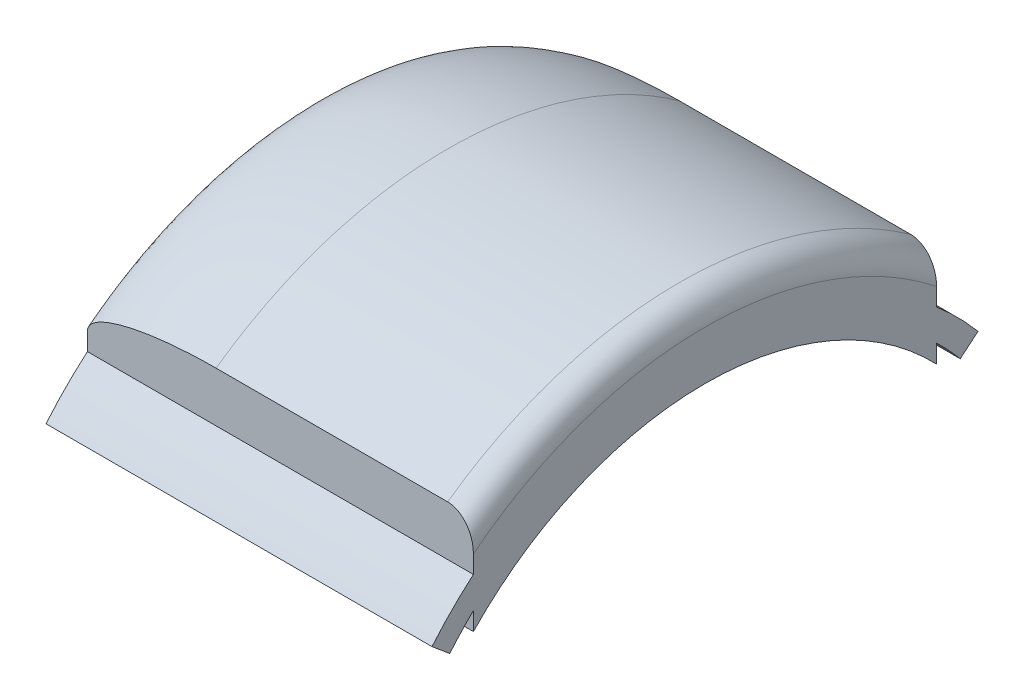
ISO-10303-21;
HEADER;
FILE_DESCRIPTION(('STEP AP214'),'2;1');
FILE_NAME('part.step','',(''),(''),'','','');
FILE_SCHEMA(('AUTOMOTIVE_DESIGN { 1 0 10303 214 1 1 1 1 }'));
ENDSEC;
DATA;
#1=APPLICATION_CONTEXT('core data for automotive mechanical design processes');
#2=APPLICATION_PROTOCOL_DEFINITION('international standard','automotive_design',2000,#1);
#3=PRODUCT_CONTEXT('',#1,'mechanical');
#4=PRODUCT('Part','Part','',(#3));
#5=PRODUCT_RELATED_PRODUCT_CATEGORY('part','',(#4));
#6=PRODUCT_DEFINITION_FORMATION('','',#4);
#7=PRODUCT_DEFINITION_CONTEXT('part definition',#1,'design');
#8=PRODUCT_DEFINITION('design','',#6,#7);
#9=PRODUCT_DEFINITION_SHAPE('','',#8);
#10=(LENGTH_UNIT() NAMED_UNIT(*) SI_UNIT(.MILLI.,.METRE.));
#11=(NAMED_UNIT(*) PLANE_ANGLE_UNIT() SI_UNIT($,.RADIAN.));
#12=(NAMED_UNIT(*) SI_UNIT($,.STERADIAN.) SOLID_ANGLE_UNIT());
#13=UNCERTAINTY_MEASURE_WITH_UNIT(LENGTH_MEASURE(1.E-05),#10,'distance_accuracy_value','');
#14=(GEOMETRIC_REPRESENTATION_CONTEXT(3) GLOBAL_UNCERTAINTY_ASSIGNED_CONTEXT((#13)) GLOBAL_UNIT_ASSIGNED_CONTEXT((#10,
#11,#12)) REPRESENTATION_CONTEXT('',''));
#15=CARTESIAN_POINT('',(0.,0.,0.));
#16=DIRECTION('',(0.,0.,1.));
#17=DIRECTION('',(1.,0.,0.));
#18=AXIS2_PLACEMENT_3D('',#15,#16,#17);
#19=CARTESIAN_POINT('',(9.99368105866197,0.,0.));
#20=DIRECTION('',(1.,0.,0.));
#21=DIRECTION('',(0.,0.,-1.));
#22=AXIS2_PLACEMENT_3D('',#19,#20,#21);
#23=PLANE('',#22);
#24=DIRECTION('',(0.,1.,0.));
#25=VECTOR('',#24,1.);
#26=CARTESIAN_POINT('',(9.99368105866197,0.,9.));
#27=LINE('',#26,#25);
#28=CARTESIAN_POINT('',(9.99368105866197,10.6772266053315,9.));
#29=VERTEX_POINT('',#28);
#30=CARTESIAN_POINT('',(9.99368105866197,11.3687698869462,9.));
#31=VERTEX_POINT('',#30);
#32=EDGE_CURVE('E210',#29,#31,#27,.T.);
#33=ORIENTED_EDGE('',*,*,#32,.T.);
#34=CARTESIAN_POINT('',(9.99368105866197,10.7411284823532,-9.74054202421923));
#35=CARTESIAN_POINT('',(9.99368105866197,11.3390278399777,-9.08122411318734));
#36=CARTESIAN_POINT('',(9.99368105866197,11.876029441084,-8.36672543807604));
#37=CARTESIAN_POINT('',(9.99368105866197,12.8101509913579,-6.85143790895524));
#38=CARTESIAN_POINT('',(9.99368105866197,13.2072478210634,-6.05068383198596));
#39=CARTESIAN_POINT('',(9.99368105866197,13.8481162679346,-4.38997103309587));
#40=CARTESIAN_POINT('',(9.99368105866197,14.0918756244839,-3.53004408268645));
#41=CARTESIAN_POINT('',(9.99368105866197,14.4178206083852,-1.78006144446919));
#42=CARTESIAN_POINT('',(9.99368105866197,14.5,-0.89003923601606));
#43=CARTESIAN_POINT('',(9.99368105866197,14.5,0.890039236016077));
#44=CARTESIAN_POINT('',(9.99368105866197,14.4178206083845,1.7800614444692));
#45=CARTESIAN_POINT('',(9.99368105866197,14.0918756244846,3.53004408268646));
#46=CARTESIAN_POINT('',(9.99368105866197,13.8481162679346,4.3899710330955));
#47=CARTESIAN_POINT('',(9.99368105866197,13.2072478210634,6.05068383198636));
#48=CARTESIAN_POINT('',(9.99368105866197,12.8101509913571,6.85143790895525));
#49=CARTESIAN_POINT('',(9.99368105866197,11.8760294410847,8.36672543807604));
#50=CARTESIAN_POINT('',(9.99368105866197,11.3390278399762,9.08122411318656));
#51=CARTESIAN_POINT('',(9.99368105866197,10.7411284823532,9.74054202421923));
#52=(BOUNDED_CURVE() B_SPLINE_CURVE(3,(#34,#35,#36,#37,#38,#39,#40,#41,#42,#43,#44,#45,#46,#47,
#48,#49,#50,#51),.UNSPECIFIED.,.F.,.F.) B_SPLINE_CURVE_WITH_KNOTS((4,2,2,2,2,2,2,2,4),
(0.834212130887358,1.01835817986424,1.20250422884113,1.38665027781801,1.5707963267949,
1.75494237577178,1.93908842474867,2.12323447372555,2.30738052270244),
.UNSPECIFIED.) CURVE() GEOMETRIC_REPRESENTATION_ITEM() RATIONAL_B_SPLINE_CURVE((1.,1.,1.,1.,1.,
1.,1.,1.,1.,1.,1.,1.,1.,1.,1.,1.,1.,1.)) REPRESENTATION_ITEM(''));
#53=CARTESIAN_POINT('',(9.99368105866197,11.3687698869544,-9.));
#54=VERTEX_POINT('',#53);
#55=EDGE_CURVE('E54',#31,#54,#52,.F.);
#56=ORIENTED_EDGE('',*,*,#55,.T.);
#57=DIRECTION('',(0.,1.,0.));
#58=VECTOR('',#57,1.);
#59=CARTESIAN_POINT('',(9.99368105866197,0.,-9.));
#60=LINE('',#59,#58);
#61=CARTESIAN_POINT('',(9.99368105866197,10.6772266053315,-9.));
#62=VERTEX_POINT('',#61);
#63=EDGE_CURVE('E330',#62,#54,#60,.T.);
#64=ORIENTED_EDGE('',*,*,#63,.F.);
#65=CARTESIAN_POINT('',(9.99368105866197,0.149999999999999,0.));
#66=DIRECTION('',(1.,0.,0.));
#67=DIRECTION('',(0.,0.,-1.));
#68=AXIS2_PLACEMENT_3D('',#65,#66,#67);
#69=CIRCLE('',#68,13.85);
#70=CARTESIAN_POINT('',(9.99368105866197,9.05260839415855,-10.6097155371979));
#71=VERTEX_POINT('',#70);
#72=EDGE_CURVE('E173',#71,#62,#69,.T.);
#73=ORIENTED_EDGE('',*,*,#72,.F.);
#74=DIRECTION('',(0.,-0.642787609686535,0.766044443118981));
#75=VECTOR('',#74,1.);
#76=CARTESIAN_POINT('',(9.99368105866197,0.0880236133250594,0.0738605814759481));
#77=LINE('',#76,#75);
#78=CARTESIAN_POINT('',(9.99368105866197,8.47409954544067,-9.92027553839077));
#79=VERTEX_POINT('',#78);
#80=EDGE_CURVE('E350',#71,#79,#77,.T.);
#81=ORIENTED_EDGE('',*,*,#80,.T.);
#82=CARTESIAN_POINT('',(9.99368105866197,0.149999999999999,0.));
#83=DIRECTION('',(1.,0.,0.));
#84=DIRECTION('',(0.,0.,-1.));
#85=AXIS2_PLACEMENT_3D('',#82,#83,#84);
#86=CIRCLE('',#85,12.95);
#87=CARTESIAN_POINT('',(9.99368105866197,9.46141772234496,-9.));
#88=VERTEX_POINT('',#87);
#89=EDGE_CURVE('E340',#79,#88,#86,.T.);
#90=ORIENTED_EDGE('',*,*,#89,.T.);
#91=DIRECTION('',(0.,-1.,0.));
#92=VECTOR('',#91,1.);
#93=CARTESIAN_POINT('',(9.99368105866197,0.,-9.));
#94=LINE('',#93,#92);
#95=CARTESIAN_POINT('',(9.99368105866197,8.7524705753638,-9.));
#96=VERTEX_POINT('',#95);
#97=EDGE_CURVE('E337',#88,#96,#94,.T.);
#98=ORIENTED_EDGE('',*,*,#97,.T.);
#99=CARTESIAN_POINT('',(9.99368105866197,0.149999999999999,0.));
#100=DIRECTION('',(1.,0.,0.));
#101=DIRECTION('',(0.,0.,-1.));
#102=AXIS2_PLACEMENT_3D('',#99,#100,#101);
#103=CIRCLE('',#102,12.45);
#104=CARTESIAN_POINT('',(9.99368105866197,8.75247057536379,9.));
#105=VERTEX_POINT('',#104);
#106=EDGE_CURVE('E341',#96,#105,#103,.T.);
#107=ORIENTED_EDGE('',*,*,#106,.T.);
#108=DIRECTION('',(0.,-1.,0.));
#109=VECTOR('',#108,1.);
#110=CARTESIAN_POINT('',(9.99368105866197,0.,9.));
#111=LINE('',#110,#109);
#112=CARTESIAN_POINT('',(9.99368105866197,9.46141772234495,9.));
#113=VERTEX_POINT('',#112);
#114=EDGE_CURVE('E152',#113,#105,#111,.T.);
#115=ORIENTED_EDGE('',*,*,#114,.F.);
#116=CARTESIAN_POINT('',(9.99368105866197,0.149999999999999,0.));
#117=DIRECTION('',(1.,0.,0.));
#118=DIRECTION('',(0.,0.,-1.));
#119=AXIS2_PLACEMENT_3D('',#116,#117,#118);
#120=CIRCLE('',#119,12.95);
#121=CARTESIAN_POINT('',(9.99368105866197,8.47409954544073,9.92027553839071));
#122=VERTEX_POINT('',#121);
#123=EDGE_CURVE('E146',#113,#122,#120,.T.);
#124=ORIENTED_EDGE('',*,*,#123,.T.);
#125=DIRECTION('',(0.,0.642787609686541,0.766044443118977));
#126=VECTOR('',#125,1.);
#127=CARTESIAN_POINT('',(9.99368105866197,0.0880236133250576,-0.0738605814759476));
#128=LINE('',#127,#126);
#129=CARTESIAN_POINT('',(9.99368105866197,9.05260839415862,10.6097155371978));
#130=VERTEX_POINT('',#129);
#131=EDGE_CURVE('E149',#122,#130,#128,.T.);
#132=ORIENTED_EDGE('',*,*,#131,.T.);
#133=CARTESIAN_POINT('',(9.99368105866197,0.149999999999999,0.));
#134=DIRECTION('',(1.,0.,0.));
#135=DIRECTION('',(0.,0.,-1.));
#136=AXIS2_PLACEMENT_3D('',#133,#134,#135);
#137=CIRCLE('',#136,13.85);
#138=EDGE_CURVE('E171',#29,#130,#137,.T.);
#139=ORIENTED_EDGE('',*,*,#138,.F.);
#140=EDGE_LOOP('',(#33,#56,#64,#73,#81,#90,#98,#107,#115,#124,#132,#139));
#141=FACE_BOUND('',#140,.T.);
#142=ADVANCED_FACE('F40',(#141),#23,.F.);
#143=CARTESIAN_POINT('',(24.993681058662,0.,9.));
#144=DIRECTION('',(0.,0.,-1.));
#145=DIRECTION('',(-1.,0.,0.));
#146=AXIS2_PLACEMENT_3D('',#143,#144,#145);
#147=PLANE('',#146);
#148=ORIENTED_EDGE('',*,*,#114,.T.);
#149=DIRECTION('',(-1.,0.,0.));
#150=VECTOR('',#149,1.);
#151=CARTESIAN_POINT('',(24.993681058662,8.75247057536379,9.));
#152=LINE('',#151,#150);
#153=CARTESIAN_POINT('',(24.993681058662,8.75247057536379,9.));
#154=VERTEX_POINT('',#153);
#155=EDGE_CURVE('E342',#154,#105,#152,.T.);
#156=ORIENTED_EDGE('',*,*,#155,.F.);
#157=DIRECTION('',(0.,-1.,0.));
#158=VECTOR('',#157,1.);
#159=CARTESIAN_POINT('',(24.993681058662,0.,9.));
#160=LINE('',#159,#158);
#161=CARTESIAN_POINT('',(24.993681058662,9.46141772234495,9.));
#162=VERTEX_POINT('',#161);
#163=EDGE_CURVE('E155',#162,#154,#160,.T.);
#164=ORIENTED_EDGE('',*,*,#163,.F.);
#165=DIRECTION('',(-1.,0.,0.));
#166=VECTOR('',#165,1.);
#167=CARTESIAN_POINT('',(24.993681058662,9.46141772234495,9.));
#168=LINE('',#167,#166);
#169=EDGE_CURVE('E166',#162,#113,#168,.T.);
#170=ORIENTED_EDGE('',*,*,#169,.T.);
#171=EDGE_LOOP('',(#148,#156,#164,#170));
#172=FACE_BOUND('',#171,.T.);
#173=ADVANCED_FACE('F290',(#172),#147,.F.);
#174=CARTESIAN_POINT('',(24.993681058662,0.149999999999999,0.));
#175=DIRECTION('',(-1.,0.,0.));
#176=DIRECTION('',(0.,0.,1.));
#177=AXIS2_PLACEMENT_3D('',#174,#175,#176);
#178=CYLINDRICAL_SURFACE('',#177,12.45);
#179=ORIENTED_EDGE('',*,*,#106,.F.);
#180=DIRECTION('',(-1.,0.,0.));
#181=VECTOR('',#180,1.);
#182=CARTESIAN_POINT('',(24.993681058662,8.7524705753638,-9.));
#183=LINE('',#182,#181);
#184=CARTESIAN_POINT('',(24.993681058662,8.7524705753638,-9.));
#185=VERTEX_POINT('',#184);
#186=EDGE_CURVE('E366',#185,#96,#183,.T.);
#187=ORIENTED_EDGE('',*,*,#186,.F.);
#188=CARTESIAN_POINT('',(24.993681058662,0.149999999999999,0.));
#189=DIRECTION('',(1.,0.,0.));
#190=DIRECTION('',(0.,0.,-1.));
#191=AXIS2_PLACEMENT_3D('',#188,#189,#190);
#192=CIRCLE('',#191,12.45);
#193=EDGE_CURVE('E390',#185,#154,#192,.T.);
#194=ORIENTED_EDGE('',*,*,#193,.T.);
#195=ORIENTED_EDGE('',*,*,#155,.T.);
#196=EDGE_LOOP('',(#179,#187,#194,#195));
#197=FACE_BOUND('',#196,.T.);
#198=ADVANCED_FACE('F294',(#197),#178,.F.);
#199=CARTESIAN_POINT('',(24.993681058662,0.,-9.));
#200=DIRECTION('',(0.,0.,-1.));
#201=DIRECTION('',(0.,1.,0.));
#202=AXIS2_PLACEMENT_3D('',#199,#200,#201);
#203=PLANE('',#202);
#204=ORIENTED_EDGE('',*,*,#97,.F.);
#205=DIRECTION('',(-1.,0.,0.));
#206=VECTOR('',#205,1.);
#207=CARTESIAN_POINT('',(24.993681058662,9.46141772234496,-9.));
#208=LINE('',#207,#206);
#209=CARTESIAN_POINT('',(24.993681058662,9.46141772234496,-9.));
#210=VERTEX_POINT('',#209);
#211=EDGE_CURVE('E364',#210,#88,#208,.T.);
#212=ORIENTED_EDGE('',*,*,#211,.F.);
#213=DIRECTION('',(0.,-1.,0.));
#214=VECTOR('',#213,1.);
#215=CARTESIAN_POINT('',(24.993681058662,0.,-9.));
#216=LINE('',#215,#214);
#217=EDGE_CURVE('E393',#210,#185,#216,.T.);
#218=ORIENTED_EDGE('',*,*,#217,.T.);
#219=ORIENTED_EDGE('',*,*,#186,.T.);
#220=EDGE_LOOP('',(#204,#212,#218,#219));
#221=FACE_BOUND('',#220,.T.);
#222=ADVANCED_FACE('F298',(#221),#203,.T.);
#223=CARTESIAN_POINT('',(24.993681058662,0.149999999999999,0.));
#224=DIRECTION('',(-1.,0.,0.));
#225=DIRECTION('',(0.,0.,1.));
#226=AXIS2_PLACEMENT_3D('',#223,#224,#225);
#227=CYLINDRICAL_SURFACE('',#226,12.95);
#228=ORIENTED_EDGE('',*,*,#89,.F.);
#229=DIRECTION('',(-1.,0.,0.));
#230=VECTOR('',#229,1.);
#231=CARTESIAN_POINT('',(24.993681058662,8.47409954544066,-9.92027553839077));
#232=LINE('',#231,#230);
#233=CARTESIAN_POINT('',(24.993681058662,8.47409954544066,-9.92027553839077));
#234=VERTEX_POINT('',#233);
#235=EDGE_CURVE('E360',#234,#79,#232,.T.);
#236=ORIENTED_EDGE('',*,*,#235,.F.);
#237=CARTESIAN_POINT('',(24.993681058662,0.149999999999999,0.));
#238=DIRECTION('',(1.,0.,0.));
#239=DIRECTION('',(0.,0.,-1.));
#240=AXIS2_PLACEMENT_3D('',#237,#238,#239);
#241=CIRCLE('',#240,12.95);
#242=EDGE_CURVE('E397',#234,#210,#241,.T.);
#243=ORIENTED_EDGE('',*,*,#242,.T.);
#244=ORIENTED_EDGE('',*,*,#211,.T.);
#245=EDGE_LOOP('',(#228,#236,#243,#244));
#246=FACE_BOUND('',#245,.T.);
#247=ADVANCED_FACE('F302',(#246),#227,.F.);
#248=CARTESIAN_POINT('',(24.993681058662,0.0880236133250594,0.0738605814759481));
#249=DIRECTION('',(0.,-0.766044443118981,-0.642787609686535));
#250=DIRECTION('',(0.,0.642787609686535,-0.766044443118981));
#251=AXIS2_PLACEMENT_3D('',#248,#249,#250);
#252=PLANE('',#251);
#253=ORIENTED_EDGE('',*,*,#80,.F.);
#254=DIRECTION('',(-1.,0.,0.));
#255=VECTOR('',#254,1.);
#256=CARTESIAN_POINT('',(24.993681058662,9.05260839415854,-10.6097155371979));
#257=LINE('',#256,#255);
#258=CARTESIAN_POINT('',(24.993681058662,9.05260839415854,-10.6097155371979));
#259=VERTEX_POINT('',#258);
#260=EDGE_CURVE('E356',#259,#71,#257,.T.);
#261=ORIENTED_EDGE('',*,*,#260,.F.);
#262=DIRECTION('',(0.,-0.642787609686535,0.766044443118981));
#263=VECTOR('',#262,1.);
#264=CARTESIAN_POINT('',(24.993681058662,0.0880236133250594,0.0738605814759481));
#265=LINE('',#264,#263);
#266=EDGE_CURVE('E399',#259,#234,#265,.T.);
#267=ORIENTED_EDGE('',*,*,#266,.T.);
#268=ORIENTED_EDGE('',*,*,#235,.T.);
#269=EDGE_LOOP('',(#253,#261,#267,#268));
#270=FACE_BOUND('',#269,.T.);
#271=ADVANCED_FACE('F305',(#270),#252,.T.);
#272=CARTESIAN_POINT('',(24.993681058662,0.149999999999999,0.));
#273=DIRECTION('',(-1.,0.,0.));
#274=DIRECTION('',(0.,0.,1.));
#275=AXIS2_PLACEMENT_3D('',#272,#273,#274);
#276=CYLINDRICAL_SURFACE('',#275,13.85);
#277=ORIENTED_EDGE('',*,*,#72,.T.);
#278=DIRECTION('',(-1.,0.,0.));
#279=VECTOR('',#278,1.);
#280=CARTESIAN_POINT('',(24.993681058662,10.6772266053315,-9.));
#281=LINE('',#280,#279);
#282=CARTESIAN_POINT('',(24.993681058662,10.6772266053315,-9.));
#283=VERTEX_POINT('',#282);
#284=EDGE_CURVE('E199',#283,#62,#281,.T.);
#285=ORIENTED_EDGE('',*,*,#284,.F.);
#286=CARTESIAN_POINT('',(24.993681058662,0.149999999999999,0.));
#287=DIRECTION('',(1.,0.,0.));
#288=DIRECTION('',(0.,0.,-1.));
#289=AXIS2_PLACEMENT_3D('',#286,#287,#288);
#290=CIRCLE('',#289,13.85);
#291=EDGE_CURVE('E407',#259,#283,#290,.T.);
#292=ORIENTED_EDGE('',*,*,#291,.F.);
#293=ORIENTED_EDGE('',*,*,#260,.T.);
#294=EDGE_LOOP('',(#277,#285,#292,#293));
#295=FACE_BOUND('',#294,.T.);
#296=ADVANCED_FACE('F228',(#295),#276,.T.);
#297=CARTESIAN_POINT('',(24.993681058662,0.,-9.));
#298=DIRECTION('',(0.,0.,-1.));
#299=DIRECTION('',(-1.,0.,0.));
#300=AXIS2_PLACEMENT_3D('',#297,#298,#299);
#301=PLANE('',#300);
#302=ORIENTED_EDGE('',*,*,#63,.T.);
#303=CARTESIAN_POINT('',(14.993681058662,12.6193808850667,-9.));
#304=CARTESIAN_POINT('',(14.9190096565153,12.6193797174583,-9.00000043074987));
#305=CARTESIAN_POINT('',(14.8443382248333,12.6189673355557,-9.00000363205342));
#306=CARTESIAN_POINT('',(14.69478269411,12.6173144911234,-9.00001147708891));
#307=CARTESIAN_POINT('',(14.6198986222249,12.6160715724419,-9.00001612507728));
#308=CARTESIAN_POINT('',(14.470164174319,12.6127523018588,-9.00002271263917));
#309=CARTESIAN_POINT('',(14.3953137945418,12.6106761196829,-9.00002465276388));
#310=CARTESIAN_POINT('',(14.2458967292287,12.605687162941,-9.00002468316303));
#311=CARTESIAN_POINT('',(14.1713299476892,12.6027772691408,-9.00002278656024));
#312=CARTESIAN_POINT('',(14.0227307540161,12.596122182108,-9.00001631304674));
#313=CARTESIAN_POINT('',(13.9486980877416,12.5923826759011,-9.0000117540551));
#314=CARTESIAN_POINT('',(13.801415543027,12.5840735814369,-9.00000357075533));
#315=CARTESIAN_POINT('',(13.7281651804892,12.5795125901366,-8.99999993762887));
#316=CARTESIAN_POINT('',(13.5788857207702,12.5693094314519,-9.00000006478963));
#317=CARTESIAN_POINT('',(13.5028590123244,12.5636321983651,-9.00000411722472));
#318=CARTESIAN_POINT('',(13.3512902366293,12.5513184127179,-9.00001357502513));
#319=CARTESIAN_POINT('',(13.2757477425603,12.5446871235771,-9.00001897307934));
#320=CARTESIAN_POINT('',(13.1254358712454,12.5304615724894,-9.00002673632242));
#321=CARTESIAN_POINT('',(13.0506656295119,12.5228764673596,-9.00002912824213));
#322=CARTESIAN_POINT('',(12.9021909378287,12.5067440265703,-9.00002919238779));
#323=CARTESIAN_POINT('',(12.8284850283471,12.4982101572358,-9.0000269242592));
#324=CARTESIAN_POINT('',(12.6824324253877,12.4801849423723,-9.00001950167068));
#325=CARTESIAN_POINT('',(12.6100834858409,12.4707118499712,-9.00001439576659));
#326=CARTESIAN_POINT('',(12.467035405227,12.4508188171009,-9.00000391304679));
#327=CARTESIAN_POINT('',(12.3963329976822,12.440422419148,-8.99999854398488));
#328=CARTESIAN_POINT('',(12.2477559044739,12.4172734408698,-9.000001607778));
#329=CARTESIAN_POINT('',(12.1699017683056,12.4043882206935,-9.00001153756071));
#330=CARTESIAN_POINT('',(12.0156389332786,12.3771985447925,-9.0000368794259));
#331=CARTESIAN_POINT('',(11.9392260087616,12.3629181517716,-9.00005220743995));
#332=CARTESIAN_POINT('',(11.788416990871,12.3329297291879,-9.0000742162725));
#333=CARTESIAN_POINT('',(11.7140133614647,12.3172597894291,-9.0000810790181));
#334=CARTESIAN_POINT('',(11.5678126994007,12.2844910793143,-9.00008180613268));
#335=CARTESIAN_POINT('',(11.4960032913557,12.2674477905799,-9.00007604634433));
#336=CARTESIAN_POINT('',(11.3555857795079,12.2319411075447,-9.00005489114299));
#337=CARTESIAN_POINT('',(11.2869583795054,12.2135546503183,-9.00003986410534));
#338=CARTESIAN_POINT('',(11.1535007497786,12.1753765183806,-9.00001239338958));
#339=CARTESIAN_POINT('',(11.0886409915589,12.1556882980015,-8.99999986270961));
#340=CARTESIAN_POINT('',(10.9495378575011,12.1104703351389,-9.00000015898886));
#341=CARTESIAN_POINT('',(10.8754315642313,12.0845091472353,-9.00001730668249));
#342=CARTESIAN_POINT('',(10.7664872225822,12.0426850860793,-9.00003163019536));
#343=CARTESIAN_POINT('',(10.7310124530454,12.0284763904035,-9.00003453919425));
#344=CARTESIAN_POINT('',(10.661497644253,11.9992559381232,-9.00003483667227));
#345=CARTESIAN_POINT('',(10.6274445208427,11.9842755243594,-9.00003236969073));
#346=CARTESIAN_POINT('',(10.5610822265604,11.9535157366083,-9.00002348576898));
#347=CARTESIAN_POINT('',(10.5287528857872,11.93778006113,-9.00001720419835));
#348=CARTESIAN_POINT('',(10.4661448257094,11.9055134212277,-9.00000512870424));
#349=CARTESIAN_POINT('',(10.4358362388521,11.8890410317896,-8.99999932534053));
#350=CARTESIAN_POINT('',(10.3898888862363,11.8624312191522,-9.00000036419891));
#351=CARTESIAN_POINT('',(10.3739175960187,11.8528668016002,-9.0000026161743));
#352=CARTESIAN_POINT('',(10.3420664913718,11.8330704459587,-9.00000834182729));
#353=CARTESIAN_POINT('',(10.3261914666744,11.822830766363,-9.00001183296451));
#354=CARTESIAN_POINT('',(10.2947417798174,11.8016844087058,-9.00001693965649));
#355=CARTESIAN_POINT('',(10.2791697212952,11.7907738483007,-9.00001854294623));
#356=CARTESIAN_POINT('',(10.2485426393721,11.7682856704715,-9.00001886083131));
#357=CARTESIAN_POINT('',(10.2334869613514,11.7567089515003,-9.00001757923249));
#358=CARTESIAN_POINT('',(10.2114101962881,11.7388037207397,-9.00001396803365));
#359=CARTESIAN_POINT('',(10.2041550811752,11.7327627095312,-9.00001248922571));
#360=CARTESIAN_POINT('',(10.1898598995773,11.7205159298188,-9.00000938848919));
#361=CARTESIAN_POINT('',(10.1828188062431,11.7143113631547,-9.00000776746974));
#362=CARTESIAN_POINT('',(10.1689804462596,11.7017389356773,-9.00000439189935));
#363=CARTESIAN_POINT('',(10.1621817390951,11.69537266325,-9.00000263845011));
#364=CARTESIAN_POINT('',(10.1488579412939,11.6824776588781,-9.00000108677304));
#365=CARTESIAN_POINT('',(10.1423309398225,11.6759509028719,-9.00000127110319));
#366=CARTESIAN_POINT('',(10.1279209433331,11.6610224659923,-8.99999841353545));
#367=CARTESIAN_POINT('',(10.1201032877951,11.6525573623597,-8.99999455986247));
#368=CARTESIAN_POINT('',(10.1052197180186,11.6356226190748,-8.99997723314698));
#369=CARTESIAN_POINT('',(10.0981359472963,11.6271687037704,-8.99996417919322));
#370=CARTESIAN_POINT('',(10.0847127744672,11.6102587501131,-8.99993319938901));
#371=CARTESIAN_POINT('',(10.0783546065684,11.6018177044926,-8.99991550110878));
#372=CARTESIAN_POINT('',(10.0692784135303,11.5890299889955,-8.99988671485097));
#373=CARTESIAN_POINT('',(10.0663732580042,11.5848153862523,-8.99987692137816));
#374=CARTESIAN_POINT('',(10.0607433729163,11.5763892638817,-8.99985708166362));
#375=CARTESIAN_POINT('',(10.0580161892125,11.5721793884074,-8.99984704447235));
#376=CARTESIAN_POINT('',(10.052741069012,11.5637633445527,-8.9998270340766));
#377=CARTESIAN_POINT('',(10.0501906659308,11.5595587230425,-8.9998170634785));
#378=CARTESIAN_POINT('',(10.0452677790983,11.5511536470993,-8.99979751317741));
#379=CARTESIAN_POINT('',(10.0428928328403,11.5469546366242,-8.99978792964642));
#380=CARTESIAN_POINT('',(10.0383194990499,11.5385612873441,-8.99976947167581));
#381=CARTESIAN_POINT('',(10.0361186689111,11.5343682808194,-8.99976058744155));
#382=CARTESIAN_POINT('',(10.0318921436039,11.5259874330737,-8.99974384220363));
#383=CARTESIAN_POINT('',(10.0298640435363,11.5218008059851,-8.99973596591212));
#384=CARTESIAN_POINT('',(10.0259814994314,11.513433212485,-8.99972154518661));
#385=CARTESIAN_POINT('',(10.0241247070274,11.5092533369092,-8.99971498056643));
#386=CARTESIAN_POINT('',(10.0205832424338,11.500899738085,-8.99970348643961));
#387=CARTESIAN_POINT('',(10.0188962981008,11.4967269791752,-8.99969853253307));
#388=CARTESIAN_POINT('',(10.015692938223,11.4883881004968,-8.99969055745594));
#389=CARTESIAN_POINT('',(10.0141743468516,11.4842228175009,-8.99968750844674));
#390=CARTESIAN_POINT('',(10.0113060468888,11.4758993700501,-8.99968363501179));
#391=CARTESIAN_POINT('',(10.0099542788024,11.4717419160917,-8.99968278016162));
#392=CARTESIAN_POINT('',(10.0074179265845,11.4634345962513,-8.9996835809672));
#393=CARTESIAN_POINT('',(10.0062314186708,11.4592853183597,-8.99968520452898));
#394=CARTESIAN_POINT('',(10.0040238372981,11.4509948076973,-8.99969124203145));
#395=CARTESIAN_POINT('',(10.0030009939322,11.4468540466907,-8.99969562316932));
#396=CARTESIAN_POINT('',(10.0011189447775,11.4385810117311,-8.99970744956169));
#397=CARTESIAN_POINT('',(10.0002581393012,11.4344491020231,-8.9997148622873));
#398=CARTESIAN_POINT('',(9.99869832355897,11.4261941940603,-8.99973301934878));
#399=CARTESIAN_POINT('',(9.99799789780808,11.4220714634657,-8.99974373241051));
#400=CARTESIAN_POINT('',(9.99675696344066,11.4138353181196,-8.99976875150965));
#401=CARTESIAN_POINT('',(9.99621523459945,11.409722087295,-8.99978302847895));
#402=CARTESIAN_POINT('',(9.99528976347058,11.4015053248565,-8.99981543006484));
#403=CARTESIAN_POINT('',(9.9949050041608,11.3974019077826,-8.99983352872102));
#404=CARTESIAN_POINT('',(9.99429157237611,11.3892051305604,-8.99987382375656));
#405=CARTESIAN_POINT('',(9.9940620900023,11.3851118309415,-8.99989599809449));
#406=CARTESIAN_POINT('',(9.99375705772431,11.376935631654,-8.99994468236465));
#407=CARTESIAN_POINT('',(9.99368090668716,11.3728527542944,-8.99997117492374));
#408=CARTESIAN_POINT('',(9.99368105866197,11.368769886954,-9.00000000000213));
#409=B_SPLINE_CURVE_WITH_KNOTS('',3,(#303,#304,#305,#306,#307,#308,#309,#310,#311,#312,#313,
#314,#315,#316,#317,#318,#319,#320,#321,#322,#323,#324,#325,#326,#327,#328,#329,#330,#331,#332,
#333,#334,#335,#336,#337,#338,#339,#340,#341,#342,#343,#344,#345,#346,#347,#348,#349,#350,#351,
#352,#353,#354,#355,#356,#357,#358,#359,#360,#361,#362,#363,#364,#365,#366,#367,#368,#369,#370,
#371,#372,#373,#374,#375,#376,#377,#378,#379,#380,#381,#382,#383,#384,#385,#386,#387,#388,#389,
#390,#391,#392,#393,#394,#395,#396,#397,#398,#399,#400,#401,#402,#403,#404,#405,#406,#407,#408),
.UNSPECIFIED.,.F.,.F.,(4,2,2,2,2,2,2,2,2,2,2,2,2,2,2,2,2,2,2,2,2,2,2,2,2,2,2,2,2,2,2,2,2,2,2,2,
2,2,2,2,2,2,2,2,2,2,2,2,2,2,2,2,4),(0.,0.224013126417754,0.448691677620939,0.673324487747464,
0.897190285116356,1.1195664523967,1.33973798791722,1.56844684205282,1.79593915333975,
2.02139393046613,2.24398102144246,2.46287183388679,2.67725064014022,2.91397450806751,
3.14716391302845,3.37524924786698,3.59663571393959,3.80974350458115,4.01305462882559,
4.24849869924771,4.36312532983001,4.47470819447807,4.58254551213436,4.68598654478415,
4.74182673418002,4.798487157252,4.85551369692068,4.91246504948115,4.94078470228091,
4.96893493638609,4.99687243477486,5.02455868380414,5.05911390556763,5.09218905099486,
5.12387546492048,5.13923033652191,5.15427626317266,5.16902707862763,5.18349713003762,
5.19770125888416,5.21165477593921,5.22537342977245,5.23887336844522,5.25217109418747,
5.26528341104871,5.27822736574232,5.29102018215623,5.30367919026692,5.31622175045478,
5.32866517445648,5.34102664438655,5.3533231313999,5.36557131563464),.UNSPECIFIED.);
#410=CARTESIAN_POINT('',(14.993681058662,12.6194133645381,-8.9999885172114));
#411=VERTEX_POINT('',#410);
#412=EDGE_CURVE('E12',#54,#411,#409,.F.);
#413=ORIENTED_EDGE('',*,*,#412,.T.);
#414=DIRECTION('',(-1.,0.,0.));
#415=VECTOR('',#414,1.);
#416=CARTESIAN_POINT('',(24.993681058662,12.619429464124,-9.));
#417=LINE('',#416,#415);
#418=CARTESIAN_POINT('',(23.993681058662,12.619429464124,-9.));
#419=VERTEX_POINT('',#418);
#420=EDGE_CURVE('E190',#419,#411,#417,.T.);
#421=ORIENTED_EDGE('',*,*,#420,.F.);
#422=CARTESIAN_POINT('',(23.993681058662,12.619429464124,-9.));
#423=CARTESIAN_POINT('',(24.0180364539299,12.6194317804812,-9.));
#424=CARTESIAN_POINT('',(24.0423786043489,12.6183357040529,-9.));
#425=CARTESIAN_POINT('',(24.0908582888838,12.6139800253618,-9.));
#426=CARTESIAN_POINT('',(24.1149959063131,12.6107213516073,-9.));
#427=CARTESIAN_POINT('',(24.1865702032025,12.5978033140333,-9.));
#428=CARTESIAN_POINT('',(24.2334734640021,12.585000989668,-9.));
#429=CARTESIAN_POINT('',(24.3243555991093,12.5517391141249,-9.));
#430=CARTESIAN_POINT('',(24.3683381495018,12.5312894118188,-9.));
#431=CARTESIAN_POINT('',(24.4525675695495,12.4837160508305,-9.));
#432=CARTESIAN_POINT('',(24.4928102102026,12.4565849604854,-9.));
#433=CARTESIAN_POINT('',(24.5712970214056,12.3948692545593,-9.));
#434=CARTESIAN_POINT('',(24.6092542783623,12.3599220172604,-9.));
#435=CARTESIAN_POINT('',(24.6798157370165,12.2850186427736,-9.));
#436=CARTESIAN_POINT('',(24.7124184384697,12.245061107307,-9.));
#437=CARTESIAN_POINT('',(24.777386390185,12.1539133144418,-9.));
#438=CARTESIAN_POINT('',(24.8087093548701,12.1019815687563,-9.));
#439=CARTESIAN_POINT('',(24.8638660223059,11.9942729807001,-9.));
#440=CARTESIAN_POINT('',(24.8876923572867,11.938492420897,-9.));
#441=CARTESIAN_POINT('',(24.9320674082781,11.8129292889753,-9.));
#442=CARTESIAN_POINT('',(24.9510060873066,11.7425784844525,-9.));
#443=CARTESIAN_POINT('',(24.9787160563522,11.5999901694418,-9.));
#444=CARTESIAN_POINT('',(24.9874962416844,11.5277543663315,-9.));
#445=CARTESIAN_POINT('',(24.9929140439601,11.4264923054791,-9.));
#446=CARTESIAN_POINT('',(24.9936800677127,11.3976479410472,-9.));
#447=CARTESIAN_POINT('',(24.993681058662,11.3688170009021,-9.));
#448=B_SPLINE_CURVE_WITH_KNOTS('',3,(#422,#423,#424,#425,#426,#427,#428,#429,#430,#431,#432,
#433,#434,#435,#436,#437,#438,#439,#440,#441,#442,#443,#444,#445,#446,#447),.UNSPECIFIED.,.F.,
.F.,(4,2,2,2,2,2,2,2,2,2,2,2,4),(0.,0.0730159418610611,0.146000554695236,0.291067335088088,
0.435947927345625,0.58099040299601,0.735196932623527,0.889446594539727,1.07072004197435,
1.25217109442921,1.46993303358722,1.68750414419276,1.77402045234363),.UNSPECIFIED.);
#449=CARTESIAN_POINT('',(24.993681058662,11.3688170009021,-9.));
#450=VERTEX_POINT('',#449);
#451=EDGE_CURVE('E191',#419,#450,#448,.T.);
#452=ORIENTED_EDGE('',*,*,#451,.T.);
#453=DIRECTION('',(0.,-1.,0.));
#454=VECTOR('',#453,1.);
#455=CARTESIAN_POINT('',(24.993681058662,0.,-9.));
#456=LINE('',#455,#454);
#457=EDGE_CURVE('E358',#450,#283,#456,.T.);
#458=ORIENTED_EDGE('',*,*,#457,.T.);
#459=ORIENTED_EDGE('',*,*,#284,.T.);
#460=EDGE_LOOP('',(#302,#413,#421,#452,#458,#459));
#461=FACE_BOUND('',#460,.T.);
#462=ADVANCED_FACE('F222',(#461),#301,.T.);
#463=CARTESIAN_POINT('',(24.993681058662,0.,0.));
#464=DIRECTION('',(-1.,0.,0.));
#465=DIRECTION('',(0.,0.,1.));
#466=AXIS2_PLACEMENT_3D('',#463,#464,#465);
#467=CYLINDRICAL_SURFACE('',#466,15.5);
#468=ORIENTED_EDGE('',*,*,#420,.T.);
#469=CARTESIAN_POINT('',(14.993681058662,11.4818959638948,10.4123035431309));
#470=CARTESIAN_POINT('',(14.993681058662,12.1210297599741,9.70751543133662));
#471=CARTESIAN_POINT('',(14.993681058662,12.6950659542625,8.94374098552952));
#472=CARTESIAN_POINT('',(14.993681058662,13.6936096804167,7.32395086819358));
#473=CARTESIAN_POINT('',(14.993681058662,14.1180924983782,6.46797237212337));
#474=CARTESIAN_POINT('',(14.993681058662,14.8031587691713,4.69272765606758));
#475=CARTESIAN_POINT('',(14.993681058662,15.0637291158282,3.77349539873382));
#476=CARTESIAN_POINT('',(14.993681058662,15.4121530641354,1.90282430270843));
#477=CARTESIAN_POINT('',(14.993681058662,15.5,0.951421252293048));
#478=CARTESIAN_POINT('',(14.993681058662,15.5,-0.951421252293029));
#479=CARTESIAN_POINT('',(14.993681058662,15.4121530641354,-1.90282430270828));
#480=CARTESIAN_POINT('',(14.993681058662,15.0637291158281,-3.77349539873395));
#481=CARTESIAN_POINT('',(14.993681058662,14.8031587691711,-4.69272765606824));
#482=CARTESIAN_POINT('',(14.993681058662,14.1180924983785,-6.46797237212269));
#483=CARTESIAN_POINT('',(14.993681058662,13.6936096804169,-7.32395086819322));
#484=CARTESIAN_POINT('',(14.993681058662,12.6950659542623,-8.94374098552986));
#485=CARTESIAN_POINT('',(14.993681058662,12.1210297599743,-9.70751543133639));
#486=CARTESIAN_POINT('',(14.993681058662,11.4818959638948,-10.4123035431309));
#487=(BOUNDED_CURVE() B_SPLINE_CURVE(3,(#469,#470,#471,#472,#473,#474,#475,#476,#477,#478,#479,
#480,#481,#482,#483,#484,#485,#486),.UNSPECIFIED.,.F.,.F.) B_SPLINE_CURVE_WITH_KNOTS((4,2,2,2,2,
2,2,2,4),(0.834212130887358,1.01835817986424,1.20250422884113,1.38665027781801,1.5707963267949,
1.75494237577178,1.93908842474867,2.12323447372555,2.30738052270244),
.UNSPECIFIED.) CURVE() GEOMETRIC_REPRESENTATION_ITEM() RATIONAL_B_SPLINE_CURVE((1.,1.,1.,1.,1.,
1.,1.,1.,1.,1.,1.,1.,1.,1.,1.,1.,1.,1.)) REPRESENTATION_ITEM(''));
#488=CARTESIAN_POINT('',(14.993681058662,12.6194051745953,9.));
#489=VERTEX_POINT('',#488);
#490=EDGE_CURVE('E205',#411,#489,#487,.F.);
#491=ORIENTED_EDGE('',*,*,#490,.T.);
#492=DIRECTION('',(-1.,0.,0.));
#493=VECTOR('',#492,1.);
#494=CARTESIAN_POINT('',(24.993681058662,12.619429464124,9.));
#495=LINE('',#494,#493);
#496=CARTESIAN_POINT('',(23.993681058662,12.619429464124,9.));
#497=VERTEX_POINT('',#496);
#498=EDGE_CURVE('E182',#497,#489,#495,.T.);
#499=ORIENTED_EDGE('',*,*,#498,.F.);
#500=CARTESIAN_POINT('',(23.993681058662,0.,0.));
#501=DIRECTION('',(1.,0.,0.));
#502=DIRECTION('',(0.,0.,-1.));
#503=AXIS2_PLACEMENT_3D('',#500,#501,#502);
#504=CIRCLE('',#503,15.5);
#505=EDGE_CURVE('E271',#497,#419,#504,.F.);
#506=ORIENTED_EDGE('',*,*,#505,.T.);
#507=EDGE_LOOP('',(#468,#491,#499,#506));
#508=FACE_BOUND('',#507,.T.);
#509=ADVANCED_FACE('F212',(#508),#467,.T.);
#510=CARTESIAN_POINT('',(24.993681058662,0.,9.));
#511=DIRECTION('',(0.,0.,-1.));
#512=DIRECTION('',(-1.,0.,0.));
#513=AXIS2_PLACEMENT_3D('',#510,#511,#512);
#514=PLANE('',#513);
#515=ORIENTED_EDGE('',*,*,#498,.T.);
#516=CARTESIAN_POINT('',(9.99368105866197,11.3687698869545,9.00000000000061));
#517=CARTESIAN_POINT('',(9.99368091072859,11.3728022127022,8.99999999845845));
#518=CARTESIAN_POINT('',(9.99375602334764,11.3768345235118,9.00000109163622));
#519=CARTESIAN_POINT('',(9.99405674659258,11.3849113036559,9.00000520131911));
#520=CARTESIAN_POINT('',(9.99428301808538,11.3889557484022,9.00000822626737));
#521=CARTESIAN_POINT('',(9.99488775537187,11.3970565328735,9.00001595063247));
#522=CARTESIAN_POINT('',(9.99526708562792,11.4011128080077,9.00002065954272));
#523=CARTESIAN_POINT('',(9.99617939309908,11.409237012583,9.00003149616215));
#524=CARTESIAN_POINT('',(9.99671343570827,11.4133048222613,9.00003763364928));
#525=CARTESIAN_POINT('',(9.99793665918206,11.4214518583216,9.00005106790524));
#526=CARTESIAN_POINT('',(9.99862710168034,11.425530895074,9.00005837395117));
#527=CARTESIAN_POINT('',(10.000164581446,11.4337001553464,9.00007388124805));
#528=CARTESIAN_POINT('',(10.0010130680465,11.4377901057938,9.00008209047047));
#529=CARTESIAN_POINT('',(10.0028680800865,11.4459809685672,9.00009913574444));
#530=CARTESIAN_POINT('',(10.0038762311242,11.450081512327,9.00010797766522));
#531=CARTESIAN_POINT('',(10.0060519997049,11.4582933406541,9.0001260156384));
#532=CARTESIAN_POINT('',(10.0072214049765,11.4624041510242,9.00013521468723));
#533=CARTESIAN_POINT('',(10.0097210959087,11.4706362932569,9.00015368993272));
#534=CARTESIAN_POINT('',(10.0110533151546,11.4747570373362,9.00016296552728));
#535=CARTESIAN_POINT('',(10.0138800343186,11.4830088272571,9.00018131259949));
#536=CARTESIAN_POINT('',(10.0153765957935,11.4871391661228,9.00019037921079));
#537=CARTESIAN_POINT('',(10.0185333862421,11.4954099231588,9.00020802276684));
#538=CARTESIAN_POINT('',(10.0201957858208,11.4995495119577,9.00021658998743));
#539=CARTESIAN_POINT('',(10.0236856252389,11.5078385412717,9.00023294493862));
#540=CARTESIAN_POINT('',(10.025515325322,11.5119870291707,9.0002407175746));
#541=CARTESIAN_POINT('',(10.0293411234697,11.5202936219633,9.00025518918611));
#542=CARTESIAN_POINT('',(10.0313395520393,11.5244506523693,9.00026186726844));
#543=CARTESIAN_POINT('',(10.035504147812,11.5327740852591,9.00027385150172));
#544=CARTESIAN_POINT('',(10.0376726968817,11.5369392947493,9.00027913062439));
#545=CARTESIAN_POINT('',(10.0421788568535,11.5452788325653,9.00028801360076));
#546=CARTESIAN_POINT('',(10.0445188829812,11.5494518545756,9.00029158402249));
#547=CARTESIAN_POINT('',(10.0493692941331,11.5578067399891,9.00029674490679));
#548=CARTESIAN_POINT('',(10.0518821107865,11.5619871901251,9.00029829541789));
#549=CARTESIAN_POINT('',(10.057079395472,11.5703566837661,9.00029909622394));
#550=CARTESIAN_POINT('',(10.0597662964475,11.5745442156654,9.00029829972648));
#551=CARTESIAN_POINT('',(10.0653129418233,11.5829274422476,9.00029412542927));
#552=CARTESIAN_POINT('',(10.0681751050307,11.5871215321662,9.00029069485635));
#553=CARTESIAN_POINT('',(10.0771168423093,11.5998498832159,9.00027569533463));
#554=CARTESIAN_POINT('',(10.0833804928484,11.608255561577,9.00025935118248));
#555=CARTESIAN_POINT('',(10.096604111843,11.6251015497229,9.0002138111519));
#556=CARTESIAN_POINT('',(10.1035825620127,11.6335272532959,9.00018408376741));
#557=CARTESIAN_POINT('',(10.1182432452919,11.650413999377,9.0001031969675));
#558=CARTESIAN_POINT('',(10.1259429907192,11.6588598149286,9.0000511396894));
#559=CARTESIAN_POINT('',(10.1386871027464,11.6722317383512,8.9999684569958));
#560=CARTESIAN_POINT('',(10.1436183654257,11.6772663982594,8.99993726308207));
#561=CARTESIAN_POINT('',(10.1538568319311,11.6874458223093,8.99988646296389));
#562=CARTESIAN_POINT('',(10.1591706350563,11.6925839585065,8.99986749695926));
#563=CARTESIAN_POINT('',(10.1701920862402,11.7029713050346,8.99983651124232));
#564=CARTESIAN_POINT('',(10.175906261123,11.7082135808289,8.99982487834341));
#565=CARTESIAN_POINT('',(10.1877488679833,11.7188082394339,8.99980870939913));
#566=CARTESIAN_POINT('',(10.1938838330068,11.7241533049035,8.99980455158978));
#567=CARTESIAN_POINT('',(10.2134155546262,11.7407571795192,8.99980054745837));
#568=CARTESIAN_POINT('',(10.2270449536672,11.75174335556,8.99981116802597));
#569=CARTESIAN_POINT('',(10.2561856783034,11.7741785967607,8.99984490364274));
#570=CARTESIAN_POINT('',(10.2717476124372,11.785561475757,8.99986917739045));
#571=CARTESIAN_POINT('',(10.3049298730083,11.8087827603138,8.99992015201399));
#572=CARTESIAN_POINT('',(10.3225992239753,11.8205508437483,8.99994685012634));
#573=CARTESIAN_POINT('',(10.3601747993741,11.8445337978708,8.99998570378832));
#574=CARTESIAN_POINT('',(10.3801277224308,11.8566752331644,8.99999613358771));
#575=CARTESIAN_POINT('',(10.414983627596,11.8770170289775,9.00000281575812));
#576=CARTESIAN_POINT('',(10.4297855114309,11.8853917849001,9.00000215052939));
#577=CARTESIAN_POINT('',(10.4599337086169,11.9019644012615,9.00000469802706));
#578=CARTESIAN_POINT('',(10.4752847055365,11.9101537296167,9.00000800052926));
#579=CARTESIAN_POINT('',(10.5225607180864,11.9346955952,9.00001777931268));
#580=CARTESIAN_POINT('',(10.5547791928952,11.9504842738952,9.00002390272914));
#581=CARTESIAN_POINT('',(10.6209237269184,11.9813450137179,9.00003272052644));
#582=CARTESIAN_POINT('',(10.6548701801991,11.9963729751128,9.0000352880747));
#583=CARTESIAN_POINT('',(10.7241754930383,12.0256838180931,9.00003503654928));
#584=CARTESIAN_POINT('',(10.7595476146408,12.0399351705468,9.0000320685487));
#585=CARTESIAN_POINT('',(10.8681755604961,12.0818783373224,9.00001752026835));
#586=CARTESIAN_POINT('',(10.9420744279564,12.1079084510263,9.0000001604289));
#587=CARTESIAN_POINT('',(11.0811208148806,12.1533485225128,8.99999986077483));
#588=CARTESIAN_POINT('',(11.1461340782046,12.1731787488793,9.0000126749528));
#589=CARTESIAN_POINT('',(11.279946157115,12.2116308964287,9.00004076075603));
#590=CARTESIAN_POINT('',(11.3487752746154,12.2301471108605,9.0000561216026));
#591=CARTESIAN_POINT('',(11.4896346265763,12.2659017755786,9.0000777456709));
#592=CARTESIAN_POINT('',(11.5616846206783,12.283061736296,9.0000836288562));
#593=CARTESIAN_POINT('',(11.708395494988,12.316051162496,9.0000828799153));
#594=CARTESIAN_POINT('',(11.7830690169885,12.3318241305166,9.00007586084678));
#595=CARTESIAN_POINT('',(11.9344375345952,12.3620053196266,9.00005335847615));
#596=CARTESIAN_POINT('',(12.0111402066671,12.3763748438564,9.00003768826259));
#597=CARTESIAN_POINT('',(12.1659933216174,12.4037291529519,9.00001179255499));
#598=CARTESIAN_POINT('',(12.2441480520739,12.4166895757128,9.00000165342205));
#599=CARTESIAN_POINT('',(12.3931669464264,12.4399480170569,8.99999850546733));
#600=CARTESIAN_POINT('',(12.4640099793567,12.4503821999913,9.00000394410078));
#601=CARTESIAN_POINT('',(12.6073495434183,12.4703468061362,9.00001454073107));
#602=CARTESIAN_POINT('',(12.6798493765682,12.4798534676413,9.00001969036732));
#603=CARTESIAN_POINT('',(12.826211959655,12.4979416074038,9.00002717988564));
#604=CARTESIAN_POINT('',(12.9000769788016,12.5065046692748,9.00002947065512));
#605=CARTESIAN_POINT('',(13.0488760027625,12.5226911565702,9.00002940664969));
#606=CARTESIAN_POINT('',(13.1238114811413,12.5303010018408,9.0000269914288));
#607=CARTESIAN_POINT('',(13.2744578627054,12.5445716132546,9.00001915293947));
#608=CARTESIAN_POINT('',(13.3501696378815,12.5512231516497,9.00001370260423));
#609=CARTESIAN_POINT('',(13.5020789840484,12.5635729829134,9.00000415744105));
#610=CARTESIAN_POINT('',(13.5782769848682,12.5692659788529,9.00000007003028));
#611=CARTESIAN_POINT('',(13.7277510285832,12.5794860466823,8.99999993271417));
#612=CARTESIAN_POINT('',(13.8010245537106,12.5840500675448,9.00000357409633));
#613=CARTESIAN_POINT('',(13.948354202373,12.5923646948114,9.00001177062438));
#614=CARTESIAN_POINT('',(14.0224108108406,12.5961066925571,9.00001633456059));
#615=CARTESIAN_POINT('',(14.1710584243365,12.602766218024,9.00002281574939));
#616=CARTESIAN_POINT('',(14.2456496839362,12.6056780509847,9.00002471505554));
#617=CARTESIAN_POINT('',(14.3951159943609,12.6106703331831,9.00002468478864));
#618=CARTESIAN_POINT('',(14.4699911413531,12.6127478977205,9.00002274206562));
#619=CARTESIAN_POINT('',(14.6197751664612,12.6160693768139,9.00001614590092));
#620=CARTESIAN_POINT('',(14.694684048342,12.6173131213162,9.00001149190665));
#621=CARTESIAN_POINT('',(14.8442890010287,12.618967061226,9.00000363675514));
#622=CARTESIAN_POINT('',(14.9189850446348,12.6193797158998,9.00000043133334));
#623=CARTESIAN_POINT('',(14.993681058662,12.6193808850666,9.));
#624=B_SPLINE_CURVE_WITH_KNOTS('',3,(#516,#517,#518,#519,#520,#521,#522,#523,#524,#525,#526,
#527,#528,#529,#530,#531,#532,#533,#534,#535,#536,#537,#538,#539,#540,#541,#542,#543,#544,#545,
#546,#547,#548,#549,#550,#551,#552,#553,#554,#555,#556,#557,#558,#559,#560,#561,#562,#563,#564,
#565,#566,#567,#568,#569,#570,#571,#572,#573,#574,#575,#576,#577,#578,#579,#580,#581,#582,#583,
#584,#585,#586,#587,#588,#589,#590,#591,#592,#593,#594,#595,#596,#597,#598,#599,#600,#601,#602,
#603,#604,#605,#606,#607,#608,#609,#610,#611,#612,#613,#614,#615,#616,#617,#618,#619,#620,#621,
#622,#623),.UNSPECIFIED.,.F.,.F.,(4,2,2,2,2,2,2,2,2,2,2,2,2,2,2,2,2,2,2,2,2,2,2,2,2,2,2,2,2,2,2,
2,2,2,2,2,2,2,2,2,2,2,2,2,2,2,2,2,2,2,2,2,2,4),(0.,0.0120962530401363,0.0242457400759259,
0.0364648289061848,0.0487701477315761,0.0611785075141814,0.0737068235840054,0.0863720380413565,
0.0991910444187375,0.112180615916716,0.12535733832921,0.138737548540811,0.152337279229452,
0.166172210158913,0.180257626211333,0.194608382101231,0.209238873536743,0.2241630144551,
0.239394219857292,0.270826152412471,0.303634681702734,0.337908439736712,0.359048523034289,
0.381220868159184,0.404481943404616,0.428890036543726,0.481384983664453,0.539207784047965,
0.602877379830218,0.672928382484894,0.723943810791957,0.776135608072661,0.883737569912479,
0.995086492943392,1.10947440679607,1.34439887039657,1.54827360247767,1.76206606564257,
1.9842351556859,2.21317613179701,2.44726883039928,2.68491898384357,2.89973160114866,
3.119084269869,3.34215553651782,3.5681109301781,3.79611440420907,4.0253391838895,
4.24558063433585,4.46802890805038,4.69196830579829,4.91667549920434,5.14142850665918,
5.36551546767298),.UNSPECIFIED.);
#625=EDGE_CURVE('E69',#489,#31,#624,.F.);
#626=ORIENTED_EDGE('',*,*,#625,.T.);
#627=ORIENTED_EDGE('',*,*,#32,.F.);
#628=DIRECTION('',(-1.,0.,0.));
#629=VECTOR('',#628,1.);
#630=CARTESIAN_POINT('',(24.993681058662,10.6772266053315,9.));
#631=LINE('',#630,#629);
#632=CARTESIAN_POINT('',(24.993681058662,10.6772266053315,9.));
#633=VERTEX_POINT('',#632);
#634=EDGE_CURVE('E179',#633,#29,#631,.T.);
#635=ORIENTED_EDGE('',*,*,#634,.F.);
#636=DIRECTION('',(0.,-1.,0.));
#637=VECTOR('',#636,1.);
#638=CARTESIAN_POINT('',(24.993681058662,0.,9.));
#639=LINE('',#638,#637);
#640=CARTESIAN_POINT('',(24.993681058662,11.3688170009021,9.));
#641=VERTEX_POINT('',#640);
#642=EDGE_CURVE('E381',#641,#633,#639,.T.);
#643=ORIENTED_EDGE('',*,*,#642,.F.);
#644=CARTESIAN_POINT('',(24.993681058662,11.3688170009021,9.));
#645=CARTESIAN_POINT('',(24.9936629679758,11.4532262611688,9.));
#646=CARTESIAN_POINT('',(24.9871022372252,11.5378348850898,9.));
#647=CARTESIAN_POINT('',(24.9602403848009,11.705396004046,9.));
#648=CARTESIAN_POINT('',(24.9398477926724,11.7883336653129,9.));
#649=CARTESIAN_POINT('',(24.8894151375855,11.9354084740205,9.));
#650=CARTESIAN_POINT('',(24.8616478298786,12.0003197605983,9.));
#651=CARTESIAN_POINT('',(24.7959887725434,12.1246675530701,9.));
#652=CARTESIAN_POINT('',(24.7581268331468,12.1841194968703,9.));
#653=CARTESIAN_POINT('',(24.680123392503,12.2850123611409,9.));
#654=CARTESIAN_POINT('',(24.6416721514371,12.3277571132197,9.));
#655=CARTESIAN_POINT('',(24.5582325149786,12.4064228403168,9.));
#656=CARTESIAN_POINT('',(24.5132426508463,12.4423422780034,9.));
#657=CARTESIAN_POINT('',(24.417071609399,12.5057797420496,9.));
#658=CARTESIAN_POINT('',(24.3658403696202,12.5332226188215,9.));
#659=CARTESIAN_POINT('',(24.2589886384014,12.5774043498647,9.));
#660=CARTESIAN_POINT('',(24.2033790537588,12.5941689124509,9.));
#661=CARTESIAN_POINT('',(24.1214921720316,12.6097617707343,9.));
#662=CARTESIAN_POINT('',(24.0960597994339,12.6133808894167,9.));
#663=CARTESIAN_POINT('',(24.0449846634727,12.6182145804158,9.));
#664=CARTESIAN_POINT('',(24.0193420489944,12.6194307278124,9.));
#665=CARTESIAN_POINT('',(23.993681058662,12.619429464124,9.));
#666=B_SPLINE_CURVE_WITH_KNOTS('',3,(#644,#645,#646,#647,#648,#649,#650,#651,#652,#653,#654,
#655,#656,#657,#658,#659,#660,#661,#662,#663,#664,#665),.UNSPECIFIED.,.F.,.F.,(4,2,2,2,2,2,2,2,
2,2,4),(0.,0.253307639319123,0.508306954336947,0.719291997475875,0.929660757007266,
1.10146505206579,1.2733079985182,1.44663338270466,1.61953988844835,1.69650890080673,
1.77342744539226),.UNSPECIFIED.);
#667=EDGE_CURVE('E275',#641,#497,#666,.T.);
#668=ORIENTED_EDGE('',*,*,#667,.T.);
#669=EDGE_LOOP('',(#515,#626,#627,#635,#643,#668));
#670=FACE_BOUND('',#669,.T.);
#671=ADVANCED_FACE('F221',(#670),#514,.F.);
#672=CARTESIAN_POINT('',(24.993681058662,0.149999999999999,0.));
#673=DIRECTION('',(-1.,0.,0.));
#674=DIRECTION('',(0.,0.,1.));
#675=AXIS2_PLACEMENT_3D('',#672,#673,#674);
#676=CYLINDRICAL_SURFACE('',#675,13.85);
#677=ORIENTED_EDGE('',*,*,#138,.T.);
#678=DIRECTION('',(-1.,0.,0.));
#679=VECTOR('',#678,1.);
#680=CARTESIAN_POINT('',(24.993681058662,9.05260839415862,10.6097155371978));
#681=LINE('',#680,#679);
#682=CARTESIAN_POINT('',(24.993681058662,9.05260839415862,10.6097155371978));
#683=VERTEX_POINT('',#682);
#684=EDGE_CURVE('E165',#683,#130,#681,.T.);
#685=ORIENTED_EDGE('',*,*,#684,.F.);
#686=CARTESIAN_POINT('',(24.993681058662,0.149999999999999,0.));
#687=DIRECTION('',(1.,0.,0.));
#688=DIRECTION('',(0.,0.,-1.));
#689=AXIS2_PLACEMENT_3D('',#686,#687,#688);
#690=CIRCLE('',#689,13.85);
#691=EDGE_CURVE('E378',#633,#683,#690,.T.);
#692=ORIENTED_EDGE('',*,*,#691,.F.);
#693=ORIENTED_EDGE('',*,*,#634,.T.);
#694=EDGE_LOOP('',(#677,#685,#692,#693));
#695=FACE_BOUND('',#694,.T.);
#696=ADVANCED_FACE('F377',(#695),#676,.T.);
#697=CARTESIAN_POINT('',(24.993681058662,0.0880236133250576,-0.0738605814759476));
#698=DIRECTION('',(0.,-0.766044443118977,0.642787609686541));
#699=DIRECTION('',(0.,-0.642787609686541,-0.766044443118977));
#700=AXIS2_PLACEMENT_3D('',#697,#698,#699);
#701=PLANE('',#700);
#702=ORIENTED_EDGE('',*,*,#131,.F.);
#703=DIRECTION('',(-1.,0.,0.));
#704=VECTOR('',#703,1.);
#705=CARTESIAN_POINT('',(24.993681058662,8.47409954544073,9.92027553839071));
#706=LINE('',#705,#704);
#707=CARTESIAN_POINT('',(24.993681058662,8.47409954544073,9.92027553839071));
#708=VERTEX_POINT('',#707);
#709=EDGE_CURVE('E158',#708,#122,#706,.T.);
#710=ORIENTED_EDGE('',*,*,#709,.F.);
#711=DIRECTION('',(0.,0.642787609686541,0.766044443118977));
#712=VECTOR('',#711,1.);
#713=CARTESIAN_POINT('',(24.993681058662,0.0880236133250576,-0.0738605814759476));
#714=LINE('',#713,#712);
#715=EDGE_CURVE('E380',#708,#683,#714,.T.);
#716=ORIENTED_EDGE('',*,*,#715,.T.);
#717=ORIENTED_EDGE('',*,*,#684,.T.);
#718=EDGE_LOOP('',(#702,#710,#716,#717));
#719=FACE_BOUND('',#718,.T.);
#720=ADVANCED_FACE('F168',(#719),#701,.T.);
#721=CARTESIAN_POINT('',(24.993681058662,0.149999999999999,0.));
#722=DIRECTION('',(-1.,0.,0.));
#723=DIRECTION('',(0.,0.,1.));
#724=AXIS2_PLACEMENT_3D('',#721,#722,#723);
#725=CYLINDRICAL_SURFACE('',#724,12.95);
#726=ORIENTED_EDGE('',*,*,#123,.F.);
#727=ORIENTED_EDGE('',*,*,#169,.F.);
#728=CARTESIAN_POINT('',(24.993681058662,0.149999999999999,0.));
#729=DIRECTION('',(1.,0.,0.));
#730=DIRECTION('',(0.,0.,-1.));
#731=AXIS2_PLACEMENT_3D('',#728,#729,#730);
#732=CIRCLE('',#731,12.95);
#733=EDGE_CURVE('E161',#162,#708,#732,.T.);
#734=ORIENTED_EDGE('',*,*,#733,.T.);
#735=ORIENTED_EDGE('',*,*,#709,.T.);
#736=EDGE_LOOP('',(#726,#727,#734,#735));
#737=FACE_BOUND('',#736,.T.);
#738=ADVANCED_FACE('F159',(#737),#725,.F.);
#739=CARTESIAN_POINT('',(24.993681058662,0.,0.));
#740=DIRECTION('',(1.,0.,0.));
#741=DIRECTION('',(0.,0.,-1.));
#742=AXIS2_PLACEMENT_3D('',#739,#740,#741);
#743=PLANE('',#742);
#744=ORIENTED_EDGE('',*,*,#457,.F.);
#745=CARTESIAN_POINT('',(24.993681058662,0.,0.));
#746=DIRECTION('',(1.,0.,0.));
#747=DIRECTION('',(0.,0.,-1.));
#748=AXIS2_PLACEMENT_3D('',#745,#746,#747);
#749=CIRCLE('',#748,14.5);
#750=EDGE_CURVE('E277',#450,#641,#749,.T.);
#751=ORIENTED_EDGE('',*,*,#750,.T.);
#752=ORIENTED_EDGE('',*,*,#642,.T.);
#753=ORIENTED_EDGE('',*,*,#691,.T.);
#754=ORIENTED_EDGE('',*,*,#715,.F.);
#755=ORIENTED_EDGE('',*,*,#733,.F.);
#756=ORIENTED_EDGE('',*,*,#163,.T.);
#757=ORIENTED_EDGE('',*,*,#193,.F.);
#758=ORIENTED_EDGE('',*,*,#217,.F.);
#759=ORIENTED_EDGE('',*,*,#242,.F.);
#760=ORIENTED_EDGE('',*,*,#266,.F.);
#761=ORIENTED_EDGE('',*,*,#291,.T.);
#762=EDGE_LOOP('',(#744,#751,#752,#753,#754,#755,#756,#757,#758,#759,#760,#761));
#763=FACE_BOUND('',#762,.T.);
#764=ADVANCED_FACE('F288',(#763),#743,.T.);
#765=CARTESIAN_POINT('',(23.993681058662,0.,0.));
#766=DIRECTION('',(1.,0.,0.));
#767=DIRECTION('',(0.,0.,-1.));
#768=AXIS2_PLACEMENT_3D('',#765,#766,#767);
#769=TOROIDAL_SURFACE('',#768,14.5,1.);
#770=ORIENTED_EDGE('',*,*,#451,.F.);
#771=ORIENTED_EDGE('',*,*,#505,.F.);
#772=ORIENTED_EDGE('',*,*,#667,.F.);
#773=ORIENTED_EDGE('',*,*,#750,.F.);
#774=EDGE_LOOP('',(#770,#771,#772,#773));
#775=FACE_BOUND('',#774,.T.);
#776=ADVANCED_FACE('F284',(#775),#769,.T.);
#777=CARTESIAN_POINT('',(14.993681058662,11.4818959638948,-10.4123035431309));
#778=CARTESIAN_POINT('',(14.993681058662,12.1210297599743,-9.70751543133639));
#779=CARTESIAN_POINT('',(14.993681058662,12.6950659542623,-8.94374098552986));
#780=CARTESIAN_POINT('',(14.993681058662,13.6936096804169,-7.32395086819322));
#781=CARTESIAN_POINT('',(14.993681058662,14.1180924983785,-6.46797237212269));
#782=CARTESIAN_POINT('',(14.993681058662,14.8031587691711,-4.69272765606824));
#783=CARTESIAN_POINT('',(14.993681058662,15.0637291158281,-3.77349539873395));
#784=CARTESIAN_POINT('',(14.993681058662,15.4121530641354,-1.90282430270828));
#785=CARTESIAN_POINT('',(14.993681058662,15.5,-0.951421252293029));
#786=CARTESIAN_POINT('',(14.993681058662,15.5,0.951421252293048));
#787=CARTESIAN_POINT('',(14.993681058662,15.4121530641354,1.90282430270843));
#788=CARTESIAN_POINT('',(14.993681058662,15.0637291158282,3.77349539873382));
#789=CARTESIAN_POINT('',(14.993681058662,14.8031587691713,4.69272765606758));
#790=CARTESIAN_POINT('',(14.993681058662,14.1180924983782,6.46797237212337));
#791=CARTESIAN_POINT('',(14.993681058662,13.6936096804167,7.32395086819358));
#792=CARTESIAN_POINT('',(14.993681058662,12.6950659542625,8.94374098552952));
#793=CARTESIAN_POINT('',(14.993681058662,12.1210297599741,9.70751543133662));
#794=CARTESIAN_POINT('',(14.993681058662,11.4818959638948,10.4123035431309));
#795=CARTESIAN_POINT('',(9.99368105866197,11.4818959638948,-10.4123035431309));
#796=CARTESIAN_POINT('',(9.99368105866197,12.1210297599784,-9.70751543133929));
#797=CARTESIAN_POINT('',(9.99368105866197,12.6950659542615,-8.94374098553017));
#798=CARTESIAN_POINT('',(9.99368105866197,13.6936096804177,-7.32395086819292));
#799=CARTESIAN_POINT('',(9.9936810586612,14.1180924983785,-6.46797237212229));
#800=CARTESIAN_POINT('',(9.99368105866274,14.8031587691711,-4.69272765606864));
#801=CARTESIAN_POINT('',(9.99368105866197,15.0637291158279,-3.77349539873391));
#802=CARTESIAN_POINT('',(9.99368105866197,15.4121530641356,-1.90282430270833));
#803=CARTESIAN_POINT('',(9.99368105866197,15.5,-0.951421252293029));
#804=CARTESIAN_POINT('',(9.99368105866197,15.5,0.951421252293048));
#805=CARTESIAN_POINT('',(9.99368105866197,15.4121530641348,1.90282430270834));
#806=CARTESIAN_POINT('',(9.99368105866197,15.0637291158287,3.77349539873392));
#807=CARTESIAN_POINT('',(9.99368105866197,14.8031587691711,4.69272765606749));
#808=CARTESIAN_POINT('',(9.99368105866197,14.1180924983785,6.46797237212346));
#809=CARTESIAN_POINT('',(9.99368105866197,13.6936096804169,7.3239508681937));
#810=CARTESIAN_POINT('',(9.99368105866197,12.6950659542623,8.9437409855294));
#811=CARTESIAN_POINT('',(9.99368105866197,12.1210297599766,9.70751543133883));
#812=CARTESIAN_POINT('',(9.99368105866197,11.4818959638948,10.4123035431309));
#813=CARTESIAN_POINT('',(9.99368105866197,10.7411284823532,-9.74054202421923));
#814=CARTESIAN_POINT('',(9.99368105866197,11.3390278399777,-9.08122411318734));
#815=CARTESIAN_POINT('',(9.99368105866197,11.876029441084,-8.36672543807604));
#816=CARTESIAN_POINT('',(9.99368105866197,12.8101509913579,-6.85143790895524));
#817=CARTESIAN_POINT('',(9.99368105866197,13.2072478210634,-6.05068383198596));
#818=CARTESIAN_POINT('',(9.99368105866197,13.8481162679346,-4.38997103309587));
#819=CARTESIAN_POINT('',(9.99368105866197,14.0918756244839,-3.53004408268645));
#820=CARTESIAN_POINT('',(9.99368105866197,14.4178206083852,-1.78006144446919));
#821=CARTESIAN_POINT('',(9.99368105866197,14.5,-0.89003923601606));
#822=CARTESIAN_POINT('',(9.99368105866197,14.5,0.890039236016077));
#823=CARTESIAN_POINT('',(9.99368105866197,14.4178206083845,1.7800614444692));
#824=CARTESIAN_POINT('',(9.99368105866197,14.0918756244846,3.53004408268646));
#825=CARTESIAN_POINT('',(9.99368105866197,13.8481162679346,4.3899710330955));
#826=CARTESIAN_POINT('',(9.99368105866197,13.2072478210634,6.05068383198636));
#827=CARTESIAN_POINT('',(9.99368105866197,12.8101509913571,6.85143790895525));
#828=CARTESIAN_POINT('',(9.99368105866197,11.8760294410847,8.36672543807604));
#829=CARTESIAN_POINT('',(9.99368105866197,11.3390278399762,9.08122411318656));
#830=CARTESIAN_POINT('',(9.99368105866197,10.7411284823532,9.74054202421923));
#831=(BOUNDED_SURFACE() B_SPLINE_SURFACE(2,3,((#777,#778,#779,#780,#781,#782,#783,#784,#785,
#786,#787,#788,#789,#790,#791,#792,#793,#794),(#795,#796,#797,#798,#799,#800,#801,#802,#803,
#804,#805,#806,#807,#808,#809,#810,#811,#812),(#813,#814,#815,#816,#817,#818,#819,#820,#821,
#822,#823,#824,#825,#826,#827,#828,#829,#830)),.UNSPECIFIED.,.F.,.F.,
.F.) B_SPLINE_SURFACE_WITH_KNOTS((3,3),(4,2,2,2,2,2,2,2,4),(0.,1.),(0.834212130887358,
1.01835817986424,1.20250422884113,1.38665027781801,1.5707963267949,1.75494237577178,
1.93908842474867,2.12323447372555,2.30738052270244),
.UNSPECIFIED.) GEOMETRIC_REPRESENTATION_ITEM() RATIONAL_B_SPLINE_SURFACE(((1.,1.,1.,1.,1.,1.,1.,
1.,1.,1.,1.,1.,1.,1.,1.,1.,1.,1.),(0.707106781186548,0.707106781186548,0.707106781186548,
0.707106781186548,0.707106781186547,0.707106781186547,0.707106781186548,0.707106781186548,
0.707106781186548,0.707106781186548,0.707106781186548,0.707106781186548,0.707106781186548,
0.707106781186548,0.707106781186547,0.707106781186547,0.707106781186548,0.707106781186548),(1.,
1.,1.,1.,1.,1.,1.,1.,1.,1.,1.,1.,1.,1.,1.,1.,1.,1.))) REPRESENTATION_ITEM('') SURFACE());
#832=ORIENTED_EDGE('',*,*,#412,.F.);
#833=ORIENTED_EDGE('',*,*,#55,.F.);
#834=ORIENTED_EDGE('',*,*,#625,.F.);
#835=ORIENTED_EDGE('',*,*,#490,.F.);
#836=EDGE_LOOP('',(#832,#833,#834,#835));
#837=FACE_BOUND('',#836,.T.);
#838=ADVANCED_FACE('F43',(#837),#831,.T.);
#839=CLOSED_SHELL('',(#142,#173,#198,#222,#247,#271,#296,#462,#509,#671,#696,#720,#738,#764,
#776,#838));
#840=MANIFOLD_SOLID_BREP('B2',#839);
#841=ADVANCED_BREP_SHAPE_REPRESENTATION('',(#18,#840),#14);
#842=SHAPE_DEFINITION_REPRESENTATION(#9,#841);
ENDSEC;
END-ISO-10303-21;
